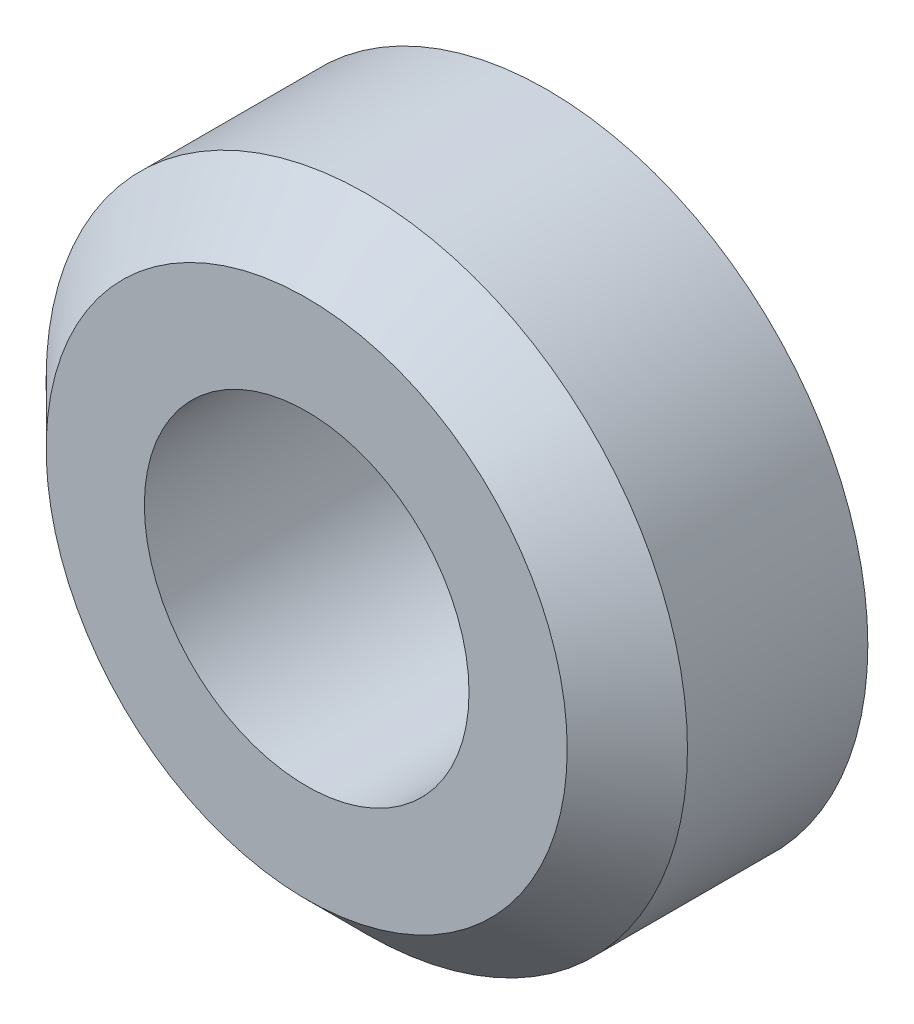
ISO-10303-21;
HEADER;
FILE_DESCRIPTION(('STEP AP214'),'2;1');
FILE_NAME('part.step','',(''),(''),'','','');
FILE_SCHEMA(('AUTOMOTIVE_DESIGN { 1 0 10303 214 1 1 1 1 }'));
ENDSEC;
DATA;
#1=APPLICATION_CONTEXT('core data for automotive mechanical design processes');
#2=APPLICATION_PROTOCOL_DEFINITION('international standard','automotive_design',2000,#1);
#3=PRODUCT_CONTEXT('',#1,'mechanical');
#4=PRODUCT('Part','Part','',(#3));
#5=PRODUCT_RELATED_PRODUCT_CATEGORY('part','',(#4));
#6=PRODUCT_DEFINITION_FORMATION('','',#4);
#7=PRODUCT_DEFINITION_CONTEXT('part definition',#1,'design');
#8=PRODUCT_DEFINITION('design','',#6,#7);
#9=PRODUCT_DEFINITION_SHAPE('','',#8);
#10=(LENGTH_UNIT() NAMED_UNIT(*) SI_UNIT(.MILLI.,.METRE.));
#11=(NAMED_UNIT(*) PLANE_ANGLE_UNIT() SI_UNIT($,.RADIAN.));
#12=(NAMED_UNIT(*) SI_UNIT($,.STERADIAN.) SOLID_ANGLE_UNIT());
#13=UNCERTAINTY_MEASURE_WITH_UNIT(LENGTH_MEASURE(1.E-05),#10,'distance_accuracy_value','');
#14=(GEOMETRIC_REPRESENTATION_CONTEXT(3) GLOBAL_UNCERTAINTY_ASSIGNED_CONTEXT((#13)) GLOBAL_UNIT_ASSIGNED_CONTEXT((#10,
#11,#12)) REPRESENTATION_CONTEXT('',''));
#15=CARTESIAN_POINT('',(0.,0.,0.));
#16=DIRECTION('',(0.,0.,1.));
#17=DIRECTION('',(1.,0.,0.));
#18=AXIS2_PLACEMENT_3D('',#15,#16,#17);
#19=CARTESIAN_POINT('',(0.,0.,6.));
#20=DIRECTION('',(0.,0.,1.));
#21=DIRECTION('',(1.,0.,0.));
#22=AXIS2_PLACEMENT_3D('',#19,#20,#21);
#23=PLANE('',#22);
#24=CARTESIAN_POINT('',(0.,0.,6.));
#25=DIRECTION('',(0.,0.,1.));
#26=DIRECTION('',(1.,0.,0.));
#27=AXIS2_PLACEMENT_3D('',#24,#25,#26);
#28=CIRCLE('',#27,6.5);
#29=CARTESIAN_POINT('',(6.5,0.,6.));
#30=VERTEX_POINT('',#29);
#31=EDGE_CURVE('E38',#30,#30,#28,.T.);
#32=ORIENTED_EDGE('',*,*,#31,.T.);
#33=EDGE_LOOP('',(#32));
#34=FACE_BOUND('',#33,.T.);
#35=CARTESIAN_POINT('',(0.,0.,6.));
#36=DIRECTION('',(0.,0.,1.));
#37=DIRECTION('',(1.,0.,0.));
#38=AXIS2_PLACEMENT_3D('',#35,#36,#37);
#39=CIRCLE('',#38,4.05);
#40=CARTESIAN_POINT('',(4.05,0.,6.));
#41=VERTEX_POINT('',#40);
#42=EDGE_CURVE('E46',#41,#41,#39,.T.);
#43=ORIENTED_EDGE('',*,*,#42,.F.);
#44=EDGE_LOOP('',(#43));
#45=FACE_BOUND('',#44,.T.);
#46=ADVANCED_FACE('F31',(#34,#45),#23,.T.);
#47=CARTESIAN_POINT('',(0.,0.,0.));
#48=DIRECTION('',(0.,0.,1.));
#49=DIRECTION('',(1.,0.,0.));
#50=AXIS2_PLACEMENT_3D('',#47,#48,#49);
#51=PLANE('',#50);
#52=CARTESIAN_POINT('',(0.,0.,0.));
#53=DIRECTION('',(0.,0.,1.));
#54=DIRECTION('',(1.,0.,0.));
#55=AXIS2_PLACEMENT_3D('',#52,#53,#54);
#56=CIRCLE('',#55,8.);
#57=CARTESIAN_POINT('',(8.,0.,0.));
#58=VERTEX_POINT('',#57);
#59=EDGE_CURVE('E42',#58,#58,#56,.T.);
#60=ORIENTED_EDGE('',*,*,#59,.F.);
#61=EDGE_LOOP('',(#60));
#62=FACE_BOUND('',#61,.T.);
#63=CARTESIAN_POINT('',(0.,0.,0.));
#64=DIRECTION('',(0.,0.,1.));
#65=DIRECTION('',(1.,0.,0.));
#66=AXIS2_PLACEMENT_3D('',#63,#64,#65);
#67=CIRCLE('',#66,4.05);
#68=CARTESIAN_POINT('',(4.05,0.,0.));
#69=VERTEX_POINT('',#68);
#70=EDGE_CURVE('E49',#69,#69,#67,.T.);
#71=ORIENTED_EDGE('',*,*,#70,.T.);
#72=EDGE_LOOP('',(#71));
#73=FACE_BOUND('',#72,.T.);
#74=ADVANCED_FACE('F59',(#62,#73),#51,.F.);
#75=CARTESIAN_POINT('',(0.,0.,6.));
#76=DIRECTION('',(0.,0.,-1.));
#77=DIRECTION('',(-1.,0.,0.));
#78=AXIS2_PLACEMENT_3D('',#75,#76,#77);
#79=CYLINDRICAL_SURFACE('',#78,8.);
#80=CARTESIAN_POINT('',(0.,0.,4.5));
#81=DIRECTION('',(0.,0.,1.));
#82=DIRECTION('',(1.,0.,0.));
#83=AXIS2_PLACEMENT_3D('',#80,#81,#82);
#84=CIRCLE('',#83,8.);
#85=CARTESIAN_POINT('',(8.,0.,4.5));
#86=VERTEX_POINT('',#85);
#87=EDGE_CURVE('E10',#86,#86,#84,.F.);
#88=ORIENTED_EDGE('',*,*,#87,.T.);
#89=EDGE_LOOP('',(#88));
#90=FACE_BOUND('',#89,.T.);
#91=ORIENTED_EDGE('',*,*,#59,.T.);
#92=EDGE_LOOP('',(#91));
#93=FACE_BOUND('',#92,.T.);
#94=ADVANCED_FACE('F64',(#90,#93),#79,.T.);
#95=CARTESIAN_POINT('',(0.,0.,6.));
#96=DIRECTION('',(0.,0.,-1.));
#97=DIRECTION('',(-1.,0.,0.));
#98=AXIS2_PLACEMENT_3D('',#95,#96,#97);
#99=CYLINDRICAL_SURFACE('',#98,4.05);
#100=ORIENTED_EDGE('',*,*,#42,.T.);
#101=EDGE_LOOP('',(#100));
#102=FACE_BOUND('',#101,.T.);
#103=ORIENTED_EDGE('',*,*,#70,.F.);
#104=EDGE_LOOP('',(#103));
#105=FACE_BOUND('',#104,.T.);
#106=ADVANCED_FACE('F55',(#102,#105),#99,.F.);
#107=CARTESIAN_POINT('',(0.,0.,6.));
#108=DIRECTION('',(0.,0.,-1.));
#109=DIRECTION('',(-1.,0.,0.));
#110=AXIS2_PLACEMENT_3D('',#107,#108,#109);
#111=CONICAL_SURFACE('',#110,6.5,0.785398163397447);
#112=ORIENTED_EDGE('',*,*,#87,.F.);
#113=EDGE_LOOP('',(#112));
#114=FACE_BOUND('',#113,.T.);
#115=ORIENTED_EDGE('',*,*,#31,.F.);
#116=EDGE_LOOP('',(#115));
#117=FACE_BOUND('',#116,.T.);
#118=ADVANCED_FACE('F33',(#114,#117),#111,.T.);
#119=CLOSED_SHELL('',(#46,#74,#94,#106,#118));
#120=MANIFOLD_SOLID_BREP('B2',#119);
#121=ADVANCED_BREP_SHAPE_REPRESENTATION('',(#18,#120),#14);
#122=SHAPE_DEFINITION_REPRESENTATION(#9,#121);
ENDSEC;
END-ISO-10303-21;
